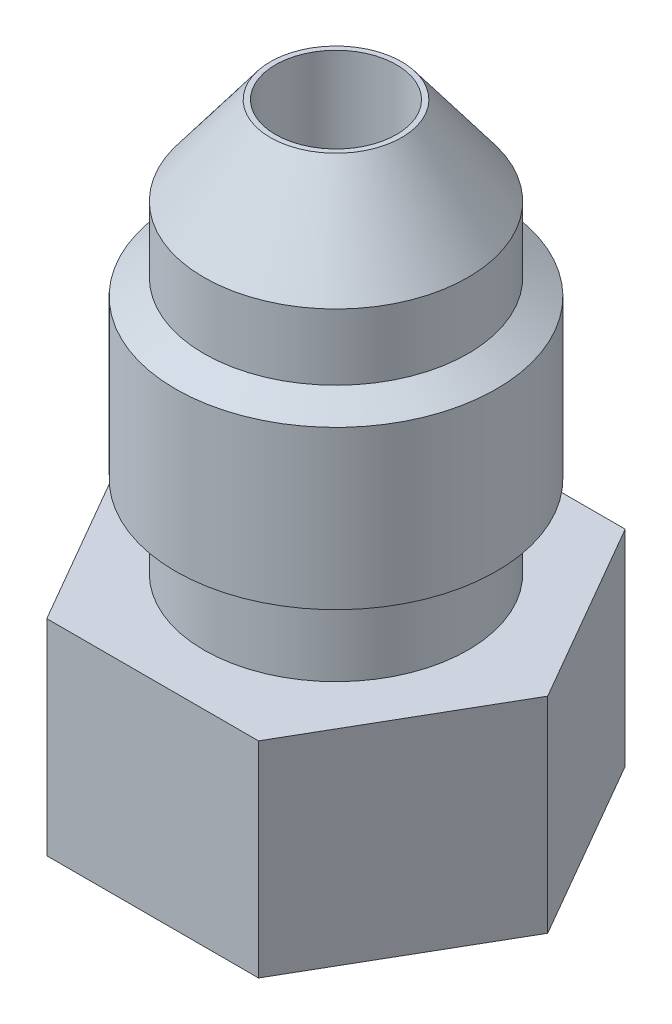
ISO-10303-21;
HEADER;
FILE_DESCRIPTION(('STEP AP214'),'2;1');
FILE_NAME('part.step','',(''),(''),'','','');
FILE_SCHEMA(('AUTOMOTIVE_DESIGN { 1 0 10303 214 1 1 1 1 }'));
ENDSEC;
DATA;
#1=APPLICATION_CONTEXT('core data for automotive mechanical design processes');
#2=APPLICATION_PROTOCOL_DEFINITION('international standard','automotive_design',2000,#1);
#3=PRODUCT_CONTEXT('',#1,'mechanical');
#4=PRODUCT('Part','Part','',(#3));
#5=PRODUCT_RELATED_PRODUCT_CATEGORY('part','',(#4));
#6=PRODUCT_DEFINITION_FORMATION('','',#4);
#7=PRODUCT_DEFINITION_CONTEXT('part definition',#1,'design');
#8=PRODUCT_DEFINITION('design','',#6,#7);
#9=PRODUCT_DEFINITION_SHAPE('','',#8);
#10=(LENGTH_UNIT() NAMED_UNIT(*) SI_UNIT(.MILLI.,.METRE.));
#11=(NAMED_UNIT(*) PLANE_ANGLE_UNIT() SI_UNIT($,.RADIAN.));
#12=(NAMED_UNIT(*) SI_UNIT($,.STERADIAN.) SOLID_ANGLE_UNIT());
#13=UNCERTAINTY_MEASURE_WITH_UNIT(LENGTH_MEASURE(1.E-05),#10,'distance_accuracy_value','');
#14=(GEOMETRIC_REPRESENTATION_CONTEXT(3) GLOBAL_UNCERTAINTY_ASSIGNED_CONTEXT((#13)) GLOBAL_UNIT_ASSIGNED_CONTEXT((#10,
#11,#12)) REPRESENTATION_CONTEXT('',''));
#15=CARTESIAN_POINT('',(0.,0.,0.));
#16=DIRECTION('',(0.,0.,1.));
#17=DIRECTION('',(1.,0.,0.));
#18=AXIS2_PLACEMENT_3D('',#15,#16,#17);
#19=CARTESIAN_POINT('',(0.,18.288,0.));
#20=DIRECTION('',(0.,-1.,0.));
#21=DIRECTION('',(0.,0.,-1.));
#22=AXIS2_PLACEMENT_3D('',#19,#20,#21);
#23=CYLINDRICAL_SURFACE('',#22,4.572);
#24=CARTESIAN_POINT('',(0.,9.398,0.));
#25=DIRECTION('',(0.,1.,0.));
#26=DIRECTION('',(0.,0.,1.));
#27=AXIS2_PLACEMENT_3D('',#24,#25,#26);
#28=CIRCLE('',#27,4.572);
#29=CARTESIAN_POINT('',(0.,9.398,4.572));
#30=VERTEX_POINT('',#29);
#31=EDGE_CURVE('E198',#30,#30,#28,.T.);
#32=ORIENTED_EDGE('',*,*,#31,.F.);
#33=EDGE_LOOP('',(#32));
#34=FACE_BOUND('',#33,.T.);
#35=CARTESIAN_POINT('',(0.,7.112,0.));
#36=DIRECTION('',(0.,1.,0.));
#37=DIRECTION('',(0.,0.,1.));
#38=AXIS2_PLACEMENT_3D('',#35,#36,#37);
#39=CIRCLE('',#38,4.572);
#40=CARTESIAN_POINT('',(0.,7.112,4.572));
#41=VERTEX_POINT('',#40);
#42=EDGE_CURVE('E179',#41,#41,#39,.T.);
#43=ORIENTED_EDGE('',*,*,#42,.T.);
#44=EDGE_LOOP('',(#43));
#45=FACE_BOUND('',#44,.T.);
#46=ADVANCED_FACE('F32',(#34,#45),#23,.T.);
#47=CARTESIAN_POINT('',(7.33234841870824,7.112,0.));
#48=DIRECTION('',(0.,1.,0.));
#49=DIRECTION('',(0.,0.,1.));
#50=AXIS2_PLACEMENT_3D('',#47,#48,#49);
#51=PLANE('',#50);
#52=DIRECTION('',(0.5,0.,-0.866025403784439));
#53=VECTOR('',#52,1.);
#54=CARTESIAN_POINT('',(3.66617420935412,7.112,6.35));
#55=LINE('',#54,#53);
#56=CARTESIAN_POINT('',(3.66617420935412,7.112,6.35));
#57=VERTEX_POINT('',#56);
#58=CARTESIAN_POINT('',(7.33234841870825,7.112,0.));
#59=VERTEX_POINT('',#58);
#60=EDGE_CURVE('E130',#57,#59,#55,.T.);
#61=ORIENTED_EDGE('',*,*,#60,.T.);
#62=DIRECTION('',(-0.5,0.,-0.866025403784438));
#63=VECTOR('',#62,1.);
#64=CARTESIAN_POINT('',(7.33234841870825,7.112,0.));
#65=LINE('',#64,#63);
#66=CARTESIAN_POINT('',(3.66617420935412,7.112,-6.35));
#67=VERTEX_POINT('',#66);
#68=EDGE_CURVE('E87',#59,#67,#65,.T.);
#69=ORIENTED_EDGE('',*,*,#68,.T.);
#70=DIRECTION('',(-1.,0.,0.));
#71=VECTOR('',#70,1.);
#72=CARTESIAN_POINT('',(3.66617420935412,7.112,-6.35));
#73=LINE('',#72,#71);
#74=CARTESIAN_POINT('',(-3.66617420935412,7.112,-6.35));
#75=VERTEX_POINT('',#74);
#76=EDGE_CURVE('E101',#67,#75,#73,.T.);
#77=ORIENTED_EDGE('',*,*,#76,.T.);
#78=DIRECTION('',(-0.5,0.,0.866025403784439));
#79=VECTOR('',#78,1.);
#80=CARTESIAN_POINT('',(-3.66617420935412,7.112,-6.35));
#81=LINE('',#80,#79);
#82=CARTESIAN_POINT('',(-7.33234841870825,7.112,0.));
#83=VERTEX_POINT('',#82);
#84=EDGE_CURVE('E94',#75,#83,#81,.T.);
#85=ORIENTED_EDGE('',*,*,#84,.T.);
#86=DIRECTION('',(0.5,0.,0.866025403784439));
#87=VECTOR('',#86,1.);
#88=CARTESIAN_POINT('',(-7.33234841870825,7.112,0.));
#89=LINE('',#88,#87);
#90=CARTESIAN_POINT('',(-3.66617420935412,7.112,6.35));
#91=VERTEX_POINT('',#90);
#92=EDGE_CURVE('E99',#83,#91,#89,.T.);
#93=ORIENTED_EDGE('',*,*,#92,.T.);
#94=DIRECTION('',(1.,0.,0.));
#95=VECTOR('',#94,1.);
#96=CARTESIAN_POINT('',(-3.66617420935412,7.112,6.35));
#97=LINE('',#96,#95);
#98=EDGE_CURVE('E50',#91,#57,#97,.T.);
#99=ORIENTED_EDGE('',*,*,#98,.T.);
#100=EDGE_LOOP('',(#61,#69,#77,#85,#93,#99));
#101=FACE_BOUND('',#100,.T.);
#102=ORIENTED_EDGE('',*,*,#42,.F.);
#103=EDGE_LOOP('',(#102));
#104=FACE_BOUND('',#103,.T.);
#105=ADVANCED_FACE('F96',(#101,#104),#51,.T.);
#106=CARTESIAN_POINT('',(3.66617420935412,7.112,6.35));
#107=DIRECTION('',(-0.866025403784439,0.,-0.5));
#108=DIRECTION('',(-0.5,0.,0.866025403784439));
#109=AXIS2_PLACEMENT_3D('',#106,#107,#108);
#110=PLANE('',#109);
#111=DIRECTION('',(0.5,0.,-0.866025403784439));
#112=VECTOR('',#111,1.);
#113=CARTESIAN_POINT('',(3.66617420935412,0.,6.35));
#114=LINE('',#113,#112);
#115=CARTESIAN_POINT('',(3.66617420935412,0.,6.35));
#116=VERTEX_POINT('',#115);
#117=CARTESIAN_POINT('',(7.33234841870825,0.,0.));
#118=VERTEX_POINT('',#117);
#119=EDGE_CURVE('E119',#116,#118,#114,.T.);
#120=ORIENTED_EDGE('',*,*,#119,.T.);
#121=DIRECTION('',(0.,-1.,0.));
#122=VECTOR('',#121,1.);
#123=CARTESIAN_POINT('',(7.33234841870825,7.112,0.));
#124=LINE('',#123,#122);
#125=EDGE_CURVE('E11',#59,#118,#124,.T.);
#126=ORIENTED_EDGE('',*,*,#125,.F.);
#127=ORIENTED_EDGE('',*,*,#60,.F.);
#128=DIRECTION('',(0.,-1.,0.));
#129=VECTOR('',#128,1.);
#130=CARTESIAN_POINT('',(3.66617420935412,7.112,6.35));
#131=LINE('',#130,#129);
#132=EDGE_CURVE('E115',#57,#116,#131,.T.);
#133=ORIENTED_EDGE('',*,*,#132,.T.);
#134=EDGE_LOOP('',(#120,#126,#127,#133));
#135=FACE_BOUND('',#134,.T.);
#136=ADVANCED_FACE('F34',(#135),#110,.F.);
#137=CARTESIAN_POINT('',(7.33234841870825,7.112,0.));
#138=DIRECTION('',(-0.866025403784439,0.,0.5));
#139=DIRECTION('',(0.5,0.,0.866025403784439));
#140=AXIS2_PLACEMENT_3D('',#137,#138,#139);
#141=PLANE('',#140);
#142=DIRECTION('',(-0.5,0.,-0.866025403784438));
#143=VECTOR('',#142,1.);
#144=CARTESIAN_POINT('',(7.33234841870825,0.,0.));
#145=LINE('',#144,#143);
#146=CARTESIAN_POINT('',(3.66617420935412,0.,-6.35));
#147=VERTEX_POINT('',#146);
#148=EDGE_CURVE('E122',#118,#147,#145,.T.);
#149=ORIENTED_EDGE('',*,*,#148,.T.);
#150=DIRECTION('',(0.,-1.,0.));
#151=VECTOR('',#150,1.);
#152=CARTESIAN_POINT('',(3.66617420935412,7.112,-6.35));
#153=LINE('',#152,#151);
#154=EDGE_CURVE('E42',#67,#147,#153,.T.);
#155=ORIENTED_EDGE('',*,*,#154,.F.);
#156=ORIENTED_EDGE('',*,*,#68,.F.);
#157=ORIENTED_EDGE('',*,*,#125,.T.);
#158=EDGE_LOOP('',(#149,#155,#156,#157));
#159=FACE_BOUND('',#158,.T.);
#160=ADVANCED_FACE('F333',(#159),#141,.F.);
#161=CARTESIAN_POINT('',(3.66617420935412,7.112,-6.35));
#162=DIRECTION('',(0.,0.,1.));
#163=DIRECTION('',(1.,0.,0.));
#164=AXIS2_PLACEMENT_3D('',#161,#162,#163);
#165=PLANE('',#164);
#166=DIRECTION('',(-1.,0.,0.));
#167=VECTOR('',#166,1.);
#168=CARTESIAN_POINT('',(3.66617420935412,0.,-6.35));
#169=LINE('',#168,#167);
#170=CARTESIAN_POINT('',(-3.66617420935412,0.,-6.35));
#171=VERTEX_POINT('',#170);
#172=EDGE_CURVE('E125',#147,#171,#169,.T.);
#173=ORIENTED_EDGE('',*,*,#172,.T.);
#174=DIRECTION('',(0.,-1.,0.));
#175=VECTOR('',#174,1.);
#176=CARTESIAN_POINT('',(-3.66617420935412,7.112,-6.35));
#177=LINE('',#176,#175);
#178=EDGE_CURVE('E110',#75,#171,#177,.T.);
#179=ORIENTED_EDGE('',*,*,#178,.F.);
#180=ORIENTED_EDGE('',*,*,#76,.F.);
#181=ORIENTED_EDGE('',*,*,#154,.T.);
#182=EDGE_LOOP('',(#173,#179,#180,#181));
#183=FACE_BOUND('',#182,.T.);
#184=ADVANCED_FACE('F137',(#183),#165,.F.);
#185=CARTESIAN_POINT('',(-3.66617420935412,7.112,-6.35));
#186=DIRECTION('',(0.866025403784439,0.,0.5));
#187=DIRECTION('',(0.5,0.,-0.866025403784439));
#188=AXIS2_PLACEMENT_3D('',#185,#186,#187);
#189=PLANE('',#188);
#190=DIRECTION('',(-0.5,0.,0.866025403784439));
#191=VECTOR('',#190,1.);
#192=CARTESIAN_POINT('',(-3.66617420935412,0.,-6.35));
#193=LINE('',#192,#191);
#194=CARTESIAN_POINT('',(-7.33234841870825,0.,0.));
#195=VERTEX_POINT('',#194);
#196=EDGE_CURVE('E109',#171,#195,#193,.T.);
#197=ORIENTED_EDGE('',*,*,#196,.T.);
#198=DIRECTION('',(0.,-1.,0.));
#199=VECTOR('',#198,1.);
#200=CARTESIAN_POINT('',(-7.33234841870825,7.112,0.));
#201=LINE('',#200,#199);
#202=EDGE_CURVE('E106',#83,#195,#201,.T.);
#203=ORIENTED_EDGE('',*,*,#202,.F.);
#204=ORIENTED_EDGE('',*,*,#84,.F.);
#205=ORIENTED_EDGE('',*,*,#178,.T.);
#206=EDGE_LOOP('',(#197,#203,#204,#205));
#207=FACE_BOUND('',#206,.T.);
#208=ADVANCED_FACE('F107',(#207),#189,.F.);
#209=CARTESIAN_POINT('',(-7.33234841870825,7.112,0.));
#210=DIRECTION('',(0.866025403784439,0.,-0.5));
#211=DIRECTION('',(-0.5,0.,-0.866025403784439));
#212=AXIS2_PLACEMENT_3D('',#209,#210,#211);
#213=PLANE('',#212);
#214=DIRECTION('',(0.5,0.,0.866025403784439));
#215=VECTOR('',#214,1.);
#216=CARTESIAN_POINT('',(-7.33234841870825,0.,0.));
#217=LINE('',#216,#215);
#218=CARTESIAN_POINT('',(-3.66617420935412,0.,6.35));
#219=VERTEX_POINT('',#218);
#220=EDGE_CURVE('E73',#195,#219,#217,.T.);
#221=ORIENTED_EDGE('',*,*,#220,.T.);
#222=DIRECTION('',(0.,-1.,0.));
#223=VECTOR('',#222,1.);
#224=CARTESIAN_POINT('',(-3.66617420935412,7.112,6.35));
#225=LINE('',#224,#223);
#226=EDGE_CURVE('E111',#91,#219,#225,.T.);
#227=ORIENTED_EDGE('',*,*,#226,.F.);
#228=ORIENTED_EDGE('',*,*,#92,.F.);
#229=ORIENTED_EDGE('',*,*,#202,.T.);
#230=EDGE_LOOP('',(#221,#227,#228,#229));
#231=FACE_BOUND('',#230,.T.);
#232=ADVANCED_FACE('F113',(#231),#213,.F.);
#233=CARTESIAN_POINT('',(-3.66617420935412,7.112,6.35));
#234=DIRECTION('',(0.,0.,-1.));
#235=DIRECTION('',(-1.,0.,0.));
#236=AXIS2_PLACEMENT_3D('',#233,#234,#235);
#237=PLANE('',#236);
#238=DIRECTION('',(1.,0.,0.));
#239=VECTOR('',#238,1.);
#240=CARTESIAN_POINT('',(-3.66617420935412,0.,6.35));
#241=LINE('',#240,#239);
#242=EDGE_CURVE('E79',#219,#116,#241,.T.);
#243=ORIENTED_EDGE('',*,*,#242,.T.);
#244=ORIENTED_EDGE('',*,*,#132,.F.);
#245=ORIENTED_EDGE('',*,*,#98,.F.);
#246=ORIENTED_EDGE('',*,*,#226,.T.);
#247=EDGE_LOOP('',(#243,#244,#245,#246));
#248=FACE_BOUND('',#247,.T.);
#249=ADVANCED_FACE('F144',(#248),#237,.F.);
#250=CARTESIAN_POINT('',(7.33234841870824,0.,0.));
#251=DIRECTION('',(0.,1.,0.));
#252=DIRECTION('',(0.,0.,1.));
#253=AXIS2_PLACEMENT_3D('',#250,#251,#252);
#254=PLANE('',#253);
#255=CARTESIAN_POINT('',(0.,0.,0.));
#256=DIRECTION('',(0.,-1.,0.));
#257=DIRECTION('',(0.,0.,-1.));
#258=AXIS2_PLACEMENT_3D('',#255,#256,#257);
#259=CIRCLE('',#258,4.0005);
#260=CARTESIAN_POINT('',(0.,0.,-4.0005));
#261=VERTEX_POINT('',#260);
#262=EDGE_CURVE('E190',#261,#261,#259,.T.);
#263=ORIENTED_EDGE('',*,*,#262,.F.);
#264=EDGE_LOOP('',(#263));
#265=FACE_BOUND('',#264,.T.);
#266=ORIENTED_EDGE('',*,*,#119,.F.);
#267=ORIENTED_EDGE('',*,*,#242,.F.);
#268=ORIENTED_EDGE('',*,*,#220,.F.);
#269=ORIENTED_EDGE('',*,*,#196,.F.);
#270=ORIENTED_EDGE('',*,*,#172,.F.);
#271=ORIENTED_EDGE('',*,*,#148,.F.);
#272=EDGE_LOOP('',(#266,#267,#268,#269,#270,#271));
#273=FACE_BOUND('',#272,.T.);
#274=ADVANCED_FACE('F140',(#265,#273),#254,.F.);
#275=CARTESIAN_POINT('',(0.,16.002,0.));
#276=DIRECTION('',(0.,1.,0.));
#277=DIRECTION('',(0.,0.,1.));
#278=AXIS2_PLACEMENT_3D('',#275,#276,#277);
#279=CIRCLE('',#278,4.572);
#280=CARTESIAN_POINT('',(0.,16.002,4.572));
#281=VERTEX_POINT('',#280);
#282=EDGE_CURVE('E176',#281,#281,#279,.T.);
#283=ORIENTED_EDGE('',*,*,#282,.T.);
#284=EDGE_LOOP('',(#283));
#285=FACE_BOUND('',#284,.T.);
#286=CARTESIAN_POINT('',(0.,18.288,0.));
#287=DIRECTION('',(0.,1.,0.));
#288=DIRECTION('',(0.,0.,1.));
#289=AXIS2_PLACEMENT_3D('',#286,#287,#288);
#290=CIRCLE('',#289,4.572);
#291=CARTESIAN_POINT('',(0.,18.288,4.572));
#292=VERTEX_POINT('',#291);
#293=EDGE_CURVE('E123',#292,#292,#290,.T.);
#294=ORIENTED_EDGE('',*,*,#293,.F.);
#295=EDGE_LOOP('',(#294));
#296=FACE_BOUND('',#295,.T.);
#297=ADVANCED_FACE('F151',(#285,#296),#23,.T.);
#298=CARTESIAN_POINT('',(0.,21.336,0.));
#299=DIRECTION('',(0.,-1.,0.));
#300=DIRECTION('',(0.,0.,-1.));
#301=AXIS2_PLACEMENT_3D('',#298,#299,#300);
#302=CONICAL_SURFACE('',#301,2.27516725528671,0.645771823237896);
#303=ORIENTED_EDGE('',*,*,#293,.T.);
#304=EDGE_LOOP('',(#303));
#305=FACE_BOUND('',#304,.T.);
#306=CARTESIAN_POINT('',(0.,21.336,0.));
#307=DIRECTION('',(0.,1.,0.));
#308=DIRECTION('',(0.,0.,1.));
#309=AXIS2_PLACEMENT_3D('',#306,#307,#308);
#310=CIRCLE('',#309,2.27516725528671);
#311=CARTESIAN_POINT('',(0.,21.336,2.27516725528671));
#312=VERTEX_POINT('',#311);
#313=EDGE_CURVE('E182',#312,#312,#310,.T.);
#314=ORIENTED_EDGE('',*,*,#313,.F.);
#315=EDGE_LOOP('',(#314));
#316=FACE_BOUND('',#315,.T.);
#317=ADVANCED_FACE('F166',(#305,#316),#302,.T.);
#318=CARTESIAN_POINT('',(-2.27516725528671,21.336,0.));
#319=DIRECTION('',(0.,1.,0.));
#320=DIRECTION('',(0.,0.,1.));
#321=AXIS2_PLACEMENT_3D('',#318,#319,#320);
#322=PLANE('',#321);
#323=CARTESIAN_POINT('',(0.,21.336,0.));
#324=DIRECTION('',(0.,1.,0.));
#325=DIRECTION('',(0.,0.,1.));
#326=AXIS2_PLACEMENT_3D('',#323,#324,#325);
#327=CIRCLE('',#326,2.0955);
#328=CARTESIAN_POINT('',(0.,21.336,2.0955));
#329=VERTEX_POINT('',#328);
#330=EDGE_CURVE('E195',#329,#329,#327,.T.);
#331=ORIENTED_EDGE('',*,*,#330,.F.);
#332=EDGE_LOOP('',(#331));
#333=FACE_BOUND('',#332,.T.);
#334=ORIENTED_EDGE('',*,*,#313,.T.);
#335=EDGE_LOOP('',(#334));
#336=FACE_BOUND('',#335,.T.);
#337=ADVANCED_FACE('F171',(#333,#336),#322,.T.);
#338=CARTESIAN_POINT('',(0.,4.7625,0.));
#339=DIRECTION('',(0.,-1.,0.));
#340=DIRECTION('',(0.,0.,-1.));
#341=AXIS2_PLACEMENT_3D('',#338,#339,#340);
#342=CYLINDRICAL_SURFACE('',#341,4.0005);
#343=CARTESIAN_POINT('',(0.,4.7625,0.));
#344=DIRECTION('',(0.,-1.,0.));
#345=DIRECTION('',(0.,0.,-1.));
#346=AXIS2_PLACEMENT_3D('',#343,#344,#345);
#347=CIRCLE('',#346,4.0005);
#348=CARTESIAN_POINT('',(0.,4.7625,-4.0005));
#349=VERTEX_POINT('',#348);
#350=EDGE_CURVE('E189',#349,#349,#347,.T.);
#351=ORIENTED_EDGE('',*,*,#350,.F.);
#352=EDGE_LOOP('',(#351));
#353=FACE_BOUND('',#352,.T.);
#354=ORIENTED_EDGE('',*,*,#262,.T.);
#355=EDGE_LOOP('',(#354));
#356=FACE_BOUND('',#355,.T.);
#357=ADVANCED_FACE('F232',(#353,#356),#342,.F.);
#358=CARTESIAN_POINT('',(0.,4.7625,0.));
#359=DIRECTION('',(0.,-1.,0.));
#360=DIRECTION('',(0.,0.,-1.));
#361=AXIS2_PLACEMENT_3D('',#358,#359,#360);
#362=PLANE('',#361);
#363=CARTESIAN_POINT('',(0.,4.7625,0.));
#364=DIRECTION('',(0.,-1.,0.));
#365=DIRECTION('',(0.,0.,-1.));
#366=AXIS2_PLACEMENT_3D('',#363,#364,#365);
#367=CIRCLE('',#366,2.0955);
#368=CARTESIAN_POINT('',(0.,4.7625,-2.0955));
#369=VERTEX_POINT('',#368);
#370=EDGE_CURVE('E36',#369,#369,#367,.T.);
#371=ORIENTED_EDGE('',*,*,#370,.F.);
#372=EDGE_LOOP('',(#371));
#373=FACE_BOUND('',#372,.T.);
#374=ORIENTED_EDGE('',*,*,#350,.T.);
#375=EDGE_LOOP('',(#374));
#376=FACE_BOUND('',#375,.T.);
#377=ADVANCED_FACE('F228',(#373,#376),#362,.T.);
#378=CARTESIAN_POINT('',(0.,0.,0.));
#379=DIRECTION('',(0.,1.,0.));
#380=DIRECTION('',(0.,0.,1.));
#381=AXIS2_PLACEMENT_3D('',#378,#379,#380);
#382=CYLINDRICAL_SURFACE('',#381,2.0955);
#383=ORIENTED_EDGE('',*,*,#370,.T.);
#384=EDGE_LOOP('',(#383));
#385=FACE_BOUND('',#384,.T.);
#386=ORIENTED_EDGE('',*,*,#330,.T.);
#387=EDGE_LOOP('',(#386));
#388=FACE_BOUND('',#387,.T.);
#389=ADVANCED_FACE('F222',(#385,#388),#382,.F.);
#390=CARTESIAN_POINT('',(0.,9.9662570024499,0.));
#391=DIRECTION('',(0.,1.,0.));
#392=DIRECTION('',(0.,0.,1.));
#393=AXIS2_PLACEMENT_3D('',#390,#391,#392);
#394=CONICAL_SURFACE('',#393,5.55625,1.04719755119659);
#395=ORIENTED_EDGE('',*,*,#31,.T.);
#396=EDGE_LOOP('',(#395));
#397=FACE_BOUND('',#396,.T.);
#398=CARTESIAN_POINT('',(0.,9.9662570024499,0.));
#399=DIRECTION('',(0.,1.,0.));
#400=DIRECTION('',(0.,0.,1.));
#401=AXIS2_PLACEMENT_3D('',#398,#399,#400);
#402=CIRCLE('',#401,5.55625);
#403=CARTESIAN_POINT('',(0.,9.9662570024499,5.55625));
#404=VERTEX_POINT('',#403);
#405=EDGE_CURVE('E201',#404,#404,#402,.T.);
#406=ORIENTED_EDGE('',*,*,#405,.F.);
#407=EDGE_LOOP('',(#406));
#408=FACE_BOUND('',#407,.T.);
#409=ADVANCED_FACE('F214',(#397,#408),#394,.T.);
#410=CARTESIAN_POINT('',(0.,22.381556864388,0.));
#411=DIRECTION('',(0.,1.,0.));
#412=DIRECTION('',(0.,0.,1.));
#413=AXIS2_PLACEMENT_3D('',#410,#411,#412);
#414=CYLINDRICAL_SURFACE('',#413,5.55625);
#415=ORIENTED_EDGE('',*,*,#405,.T.);
#416=EDGE_LOOP('',(#415));
#417=FACE_BOUND('',#416,.T.);
#418=CARTESIAN_POINT('',(0.,15.4337429975501,0.));
#419=DIRECTION('',(0.,1.,0.));
#420=DIRECTION('',(0.,0.,1.));
#421=AXIS2_PLACEMENT_3D('',#418,#419,#420);
#422=CIRCLE('',#421,5.55625);
#423=CARTESIAN_POINT('',(0.,15.4337429975501,5.55625));
#424=VERTEX_POINT('',#423);
#425=EDGE_CURVE('E204',#424,#424,#422,.T.);
#426=ORIENTED_EDGE('',*,*,#425,.F.);
#427=EDGE_LOOP('',(#426));
#428=FACE_BOUND('',#427,.T.);
#429=ADVANCED_FACE('F212',(#417,#428),#414,.T.);
#430=CARTESIAN_POINT('',(0.,16.002,0.));
#431=DIRECTION('',(0.,-1.,0.));
#432=DIRECTION('',(0.,0.,-1.));
#433=AXIS2_PLACEMENT_3D('',#430,#431,#432);
#434=CONICAL_SURFACE('',#433,4.572,1.04719755119659);
#435=ORIENTED_EDGE('',*,*,#425,.T.);
#436=EDGE_LOOP('',(#435));
#437=FACE_BOUND('',#436,.T.);
#438=ORIENTED_EDGE('',*,*,#282,.F.);
#439=EDGE_LOOP('',(#438));
#440=FACE_BOUND('',#439,.T.);
#441=ADVANCED_FACE('F209',(#437,#440),#434,.T.);
#442=CLOSED_SHELL('',(#46,#105,#136,#160,#184,#208,#232,#249,#274,#297,#317,#337,#357,#377,#389,
#409,#429,#441));
#443=MANIFOLD_SOLID_BREP('B2',#442);
#444=ADVANCED_BREP_SHAPE_REPRESENTATION('',(#18,#443),#14);
#445=SHAPE_DEFINITION_REPRESENTATION(#9,#444);
ENDSEC;
END-ISO-10303-21;
